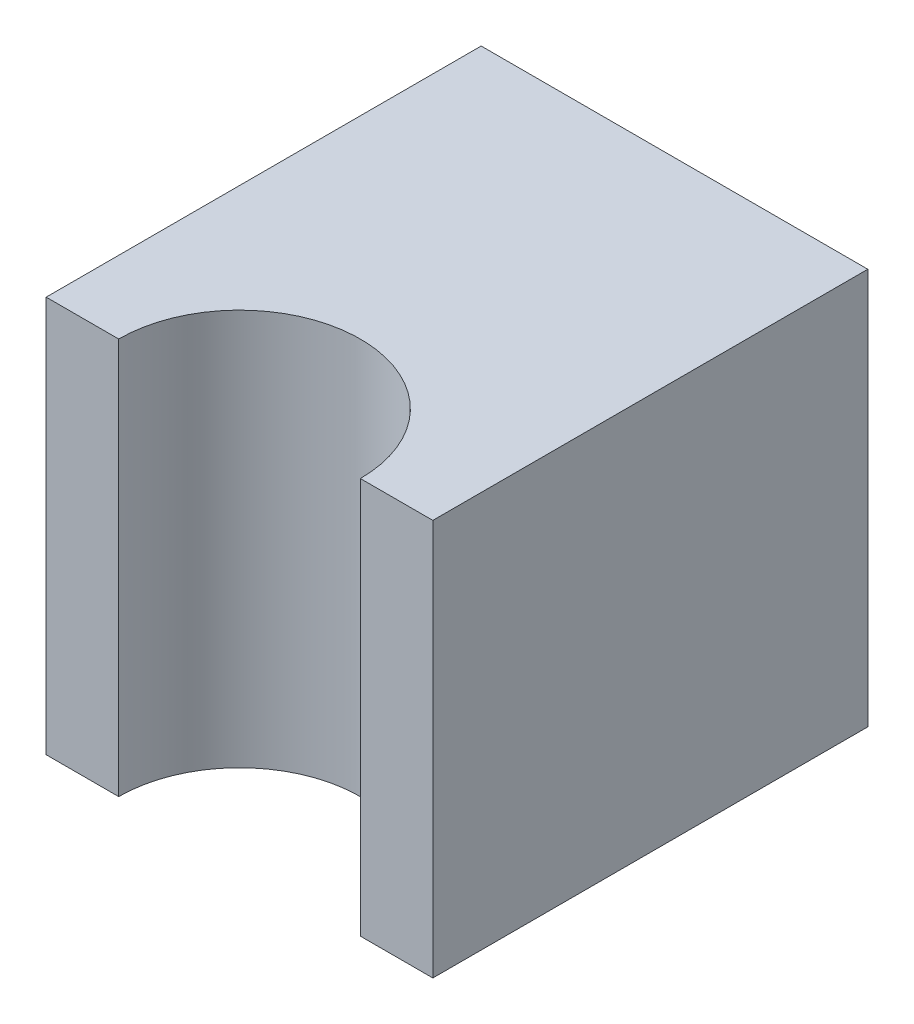
ISO-10303-21;
HEADER;
FILE_DESCRIPTION(('STEP AP214'),'2;1');
FILE_NAME('part.step','',(''),(''),'','','');
FILE_SCHEMA(('AUTOMOTIVE_DESIGN { 1 0 10303 214 1 1 1 1 }'));
ENDSEC;
DATA;
#1=APPLICATION_CONTEXT('core data for automotive mechanical design processes');
#2=APPLICATION_PROTOCOL_DEFINITION('international standard','automotive_design',2000,#1);
#3=PRODUCT_CONTEXT('',#1,'mechanical');
#4=PRODUCT('Part','Part','',(#3));
#5=PRODUCT_RELATED_PRODUCT_CATEGORY('part','',(#4));
#6=PRODUCT_DEFINITION_FORMATION('','',#4);
#7=PRODUCT_DEFINITION_CONTEXT('part definition',#1,'design');
#8=PRODUCT_DEFINITION('design','',#6,#7);
#9=PRODUCT_DEFINITION_SHAPE('','',#8);
#10=(LENGTH_UNIT() NAMED_UNIT(*) SI_UNIT(.MILLI.,.METRE.));
#11=(NAMED_UNIT(*) PLANE_ANGLE_UNIT() SI_UNIT($,.RADIAN.));
#12=(NAMED_UNIT(*) SI_UNIT($,.STERADIAN.) SOLID_ANGLE_UNIT());
#13=UNCERTAINTY_MEASURE_WITH_UNIT(LENGTH_MEASURE(1.E-05),#10,'distance_accuracy_value','');
#14=(GEOMETRIC_REPRESENTATION_CONTEXT(3) GLOBAL_UNCERTAINTY_ASSIGNED_CONTEXT((#13)) GLOBAL_UNIT_ASSIGNED_CONTEXT((#10,
#11,#12)) REPRESENTATION_CONTEXT('',''));
#15=CARTESIAN_POINT('',(0.,0.,0.));
#16=DIRECTION('',(0.,0.,1.));
#17=DIRECTION('',(1.,0.,0.));
#18=AXIS2_PLACEMENT_3D('',#15,#16,#17);
#19=CARTESIAN_POINT('',(-4.8,0.,6.1));
#20=DIRECTION('',(0.,1.,0.));
#21=DIRECTION('',(0.,0.,1.));
#22=AXIS2_PLACEMENT_3D('',#19,#20,#21);
#23=CYLINDRICAL_SURFACE('',#22,0.25);
#24=DIRECTION('',(0.,1.,0.));
#25=VECTOR('',#24,1.);
#26=CARTESIAN_POINT('',(-4.55,0.,6.1));
#27=LINE('',#26,#25);
#28=CARTESIAN_POINT('',(-4.55,0.82,6.1));
#29=VERTEX_POINT('',#28);
#30=CARTESIAN_POINT('',(-4.55,0.,6.1));
#31=VERTEX_POINT('',#30);
#32=EDGE_CURVE('E119',#29,#31,#27,.F.);
#33=ORIENTED_EDGE('',*,*,#32,.F.);
#34=CARTESIAN_POINT('',(-4.8,0.82,6.1));
#35=DIRECTION('',(0.,1.,0.));
#36=DIRECTION('',(0.,0.,1.));
#37=AXIS2_PLACEMENT_3D('',#34,#35,#36);
#38=CIRCLE('',#37,0.25);
#39=CARTESIAN_POINT('',(-5.05,0.82,6.1));
#40=VERTEX_POINT('',#39);
#41=EDGE_CURVE('E80',#40,#29,#38,.F.);
#42=ORIENTED_EDGE('',*,*,#41,.F.);
#43=DIRECTION('',(0.,1.,0.));
#44=VECTOR('',#43,1.);
#45=CARTESIAN_POINT('',(-5.05,0.,6.1));
#46=LINE('',#45,#44);
#47=CARTESIAN_POINT('',(-5.05,0.,6.1));
#48=VERTEX_POINT('',#47);
#49=EDGE_CURVE('E78',#48,#40,#46,.T.);
#50=ORIENTED_EDGE('',*,*,#49,.F.);
#51=CARTESIAN_POINT('',(-4.8,0.,6.1));
#52=DIRECTION('',(0.,1.,0.));
#53=DIRECTION('',(0.,0.,1.));
#54=AXIS2_PLACEMENT_3D('',#51,#52,#53);
#55=CIRCLE('',#54,0.25);
#56=EDGE_CURVE('E20',#48,#31,#55,.F.);
#57=ORIENTED_EDGE('',*,*,#56,.T.);
#58=EDGE_LOOP('',(#33,#42,#50,#57));
#59=FACE_BOUND('',#58,.T.);
#60=ADVANCED_FACE('F17',(#59),#23,.F.);
#61=CARTESIAN_POINT('',(-4.55,0.,6.1));
#62=DIRECTION('',(0.,0.,1.));
#63=DIRECTION('',(1.,0.,0.));
#64=AXIS2_PLACEMENT_3D('',#61,#62,#63);
#65=PLANE('',#64);
#66=DIRECTION('',(1.,0.,0.));
#67=VECTOR('',#66,1.);
#68=CARTESIAN_POINT('',(-4.8,0.82,6.1));
#69=LINE('',#68,#67);
#70=CARTESIAN_POINT('',(-4.4,0.82,6.1));
#71=VERTEX_POINT('',#70);
#72=EDGE_CURVE('E104',#29,#71,#69,.T.);
#73=ORIENTED_EDGE('',*,*,#72,.F.);
#74=ORIENTED_EDGE('',*,*,#32,.T.);
#75=DIRECTION('',(1.,0.,0.));
#76=VECTOR('',#75,1.);
#77=CARTESIAN_POINT('',(-4.8,0.,6.1));
#78=LINE('',#77,#76);
#79=CARTESIAN_POINT('',(-4.4,0.,6.1));
#80=VERTEX_POINT('',#79);
#81=EDGE_CURVE('E73',#31,#80,#78,.T.);
#82=ORIENTED_EDGE('',*,*,#81,.T.);
#83=DIRECTION('',(0.,1.,0.));
#84=VECTOR('',#83,1.);
#85=CARTESIAN_POINT('',(-4.4,0.,6.1));
#86=LINE('',#85,#84);
#87=EDGE_CURVE('E76',#71,#80,#86,.F.);
#88=ORIENTED_EDGE('',*,*,#87,.F.);
#89=EDGE_LOOP('',(#73,#74,#82,#88));
#90=FACE_BOUND('',#89,.T.);
#91=ADVANCED_FACE('F196',(#90),#65,.T.);
#92=CARTESIAN_POINT('',(-4.4,0.,6.1));
#93=DIRECTION('',(1.,0.,0.));
#94=DIRECTION('',(0.,0.,-1.));
#95=AXIS2_PLACEMENT_3D('',#92,#93,#94);
#96=PLANE('',#95);
#97=DIRECTION('',(0.,0.,1.));
#98=VECTOR('',#97,1.);
#99=CARTESIAN_POINT('',(-4.4,0.82,5.65));
#100=LINE('',#99,#98);
#101=CARTESIAN_POINT('',(-4.4,0.82,5.2));
#102=VERTEX_POINT('',#101);
#103=EDGE_CURVE('E83',#71,#102,#100,.F.);
#104=ORIENTED_EDGE('',*,*,#103,.F.);
#105=ORIENTED_EDGE('',*,*,#87,.T.);
#106=DIRECTION('',(0.,0.,1.));
#107=VECTOR('',#106,1.);
#108=CARTESIAN_POINT('',(-4.4,0.,5.65));
#109=LINE('',#108,#107);
#110=CARTESIAN_POINT('',(-4.4,0.,5.2));
#111=VERTEX_POINT('',#110);
#112=EDGE_CURVE('E89',#80,#111,#109,.F.);
#113=ORIENTED_EDGE('',*,*,#112,.T.);
#114=DIRECTION('',(0.,1.,0.));
#115=VECTOR('',#114,1.);
#116=CARTESIAN_POINT('',(-4.4,0.,5.2));
#117=LINE('',#116,#115);
#118=EDGE_CURVE('E100',#102,#111,#117,.F.);
#119=ORIENTED_EDGE('',*,*,#118,.F.);
#120=EDGE_LOOP('',(#104,#105,#113,#119));
#121=FACE_BOUND('',#120,.T.);
#122=ADVANCED_FACE('F187',(#121),#96,.T.);
#123=CARTESIAN_POINT('',(-4.8,0.,5.65));
#124=DIRECTION('',(0.,1.,0.));
#125=DIRECTION('',(0.,0.,1.));
#126=AXIS2_PLACEMENT_3D('',#123,#124,#125);
#127=PLANE('',#126);
#128=ORIENTED_EDGE('',*,*,#81,.F.);
#129=ORIENTED_EDGE('',*,*,#56,.F.);
#130=DIRECTION('',(1.,0.,0.));
#131=VECTOR('',#130,1.);
#132=CARTESIAN_POINT('',(-5.2,0.,6.1));
#133=LINE('',#132,#131);
#134=CARTESIAN_POINT('',(-5.2,0.,6.1));
#135=VERTEX_POINT('',#134);
#136=EDGE_CURVE('E70',#135,#48,#133,.T.);
#137=ORIENTED_EDGE('',*,*,#136,.F.);
#138=DIRECTION('',(0.,0.,1.));
#139=VECTOR('',#138,1.);
#140=CARTESIAN_POINT('',(-5.2,0.,5.2));
#141=LINE('',#140,#139);
#142=CARTESIAN_POINT('',(-5.2,0.,5.2));
#143=VERTEX_POINT('',#142);
#144=EDGE_CURVE('E98',#143,#135,#141,.T.);
#145=ORIENTED_EDGE('',*,*,#144,.F.);
#146=DIRECTION('',(-1.,0.,0.));
#147=VECTOR('',#146,1.);
#148=CARTESIAN_POINT('',(-4.4,0.,5.2));
#149=LINE('',#148,#147);
#150=EDGE_CURVE('E107',#111,#143,#149,.T.);
#151=ORIENTED_EDGE('',*,*,#150,.F.);
#152=ORIENTED_EDGE('',*,*,#112,.F.);
#153=EDGE_LOOP('',(#128,#129,#137,#145,#151,#152));
#154=FACE_BOUND('',#153,.T.);
#155=ADVANCED_FACE('F68',(#154),#127,.F.);
#156=CARTESIAN_POINT('',(-5.2,0.,6.1));
#157=DIRECTION('',(0.,0.,1.));
#158=DIRECTION('',(1.,0.,0.));
#159=AXIS2_PLACEMENT_3D('',#156,#157,#158);
#160=PLANE('',#159);
#161=DIRECTION('',(1.,0.,0.));
#162=VECTOR('',#161,1.);
#163=CARTESIAN_POINT('',(-4.8,0.82,6.1));
#164=LINE('',#163,#162);
#165=CARTESIAN_POINT('',(-5.2,0.82,6.1));
#166=VERTEX_POINT('',#165);
#167=EDGE_CURVE('E105',#166,#40,#164,.T.);
#168=ORIENTED_EDGE('',*,*,#167,.F.);
#169=DIRECTION('',(0.,1.,0.));
#170=VECTOR('',#169,1.);
#171=CARTESIAN_POINT('',(-5.2,0.,6.1));
#172=LINE('',#171,#170);
#173=EDGE_CURVE('E87',#135,#166,#172,.T.);
#174=ORIENTED_EDGE('',*,*,#173,.F.);
#175=ORIENTED_EDGE('',*,*,#136,.T.);
#176=ORIENTED_EDGE('',*,*,#49,.T.);
#177=EDGE_LOOP('',(#168,#174,#175,#176));
#178=FACE_BOUND('',#177,.T.);
#179=ADVANCED_FACE('F85',(#178),#160,.T.);
#180=CARTESIAN_POINT('',(-4.8,0.82,5.65));
#181=DIRECTION('',(0.,1.,0.));
#182=DIRECTION('',(0.,0.,1.));
#183=AXIS2_PLACEMENT_3D('',#180,#181,#182);
#184=PLANE('',#183);
#185=ORIENTED_EDGE('',*,*,#41,.T.);
#186=ORIENTED_EDGE('',*,*,#72,.T.);
#187=ORIENTED_EDGE('',*,*,#103,.T.);
#188=DIRECTION('',(-1.,0.,0.));
#189=VECTOR('',#188,1.);
#190=CARTESIAN_POINT('',(-4.4,0.82,5.2));
#191=LINE('',#190,#189);
#192=CARTESIAN_POINT('',(-5.2,0.82,5.2));
#193=VERTEX_POINT('',#192);
#194=EDGE_CURVE('E35',#193,#102,#191,.F.);
#195=ORIENTED_EDGE('',*,*,#194,.F.);
#196=DIRECTION('',(0.,0.,1.));
#197=VECTOR('',#196,1.);
#198=CARTESIAN_POINT('',(-5.2,0.82,5.2));
#199=LINE('',#198,#197);
#200=EDGE_CURVE('E26',#166,#193,#199,.F.);
#201=ORIENTED_EDGE('',*,*,#200,.F.);
#202=ORIENTED_EDGE('',*,*,#167,.T.);
#203=EDGE_LOOP('',(#185,#186,#187,#195,#201,#202));
#204=FACE_BOUND('',#203,.T.);
#205=ADVANCED_FACE('F145',(#204),#184,.T.);
#206=CARTESIAN_POINT('',(-4.4,0.,5.2));
#207=DIRECTION('',(0.,0.,-1.));
#208=DIRECTION('',(-1.,0.,0.));
#209=AXIS2_PLACEMENT_3D('',#206,#207,#208);
#210=PLANE('',#209);
#211=ORIENTED_EDGE('',*,*,#194,.T.);
#212=ORIENTED_EDGE('',*,*,#118,.T.);
#213=ORIENTED_EDGE('',*,*,#150,.T.);
#214=DIRECTION('',(0.,1.,0.));
#215=VECTOR('',#214,1.);
#216=CARTESIAN_POINT('',(-5.2,0.,5.2));
#217=LINE('',#216,#215);
#218=EDGE_CURVE('E11',#193,#143,#217,.F.);
#219=ORIENTED_EDGE('',*,*,#218,.F.);
#220=EDGE_LOOP('',(#211,#212,#213,#219));
#221=FACE_BOUND('',#220,.T.);
#222=ADVANCED_FACE('F141',(#221),#210,.T.);
#223=CARTESIAN_POINT('',(-5.2,0.,5.2));
#224=DIRECTION('',(-1.,0.,0.));
#225=DIRECTION('',(0.,0.,1.));
#226=AXIS2_PLACEMENT_3D('',#223,#224,#225);
#227=PLANE('',#226);
#228=ORIENTED_EDGE('',*,*,#200,.T.);
#229=ORIENTED_EDGE('',*,*,#218,.T.);
#230=ORIENTED_EDGE('',*,*,#144,.T.);
#231=ORIENTED_EDGE('',*,*,#173,.T.);
#232=EDGE_LOOP('',(#228,#229,#230,#231));
#233=FACE_BOUND('',#232,.T.);
#234=ADVANCED_FACE('F144',(#233),#227,.T.);
#235=CLOSED_SHELL('',(#60,#91,#122,#155,#179,#205,#222,#234));
#236=MANIFOLD_SOLID_BREP('B1',#235);
#237=ADVANCED_BREP_SHAPE_REPRESENTATION('',(#18,#236),#14);
#238=SHAPE_DEFINITION_REPRESENTATION(#9,#237);
ENDSEC;
END-ISO-10303-21;
